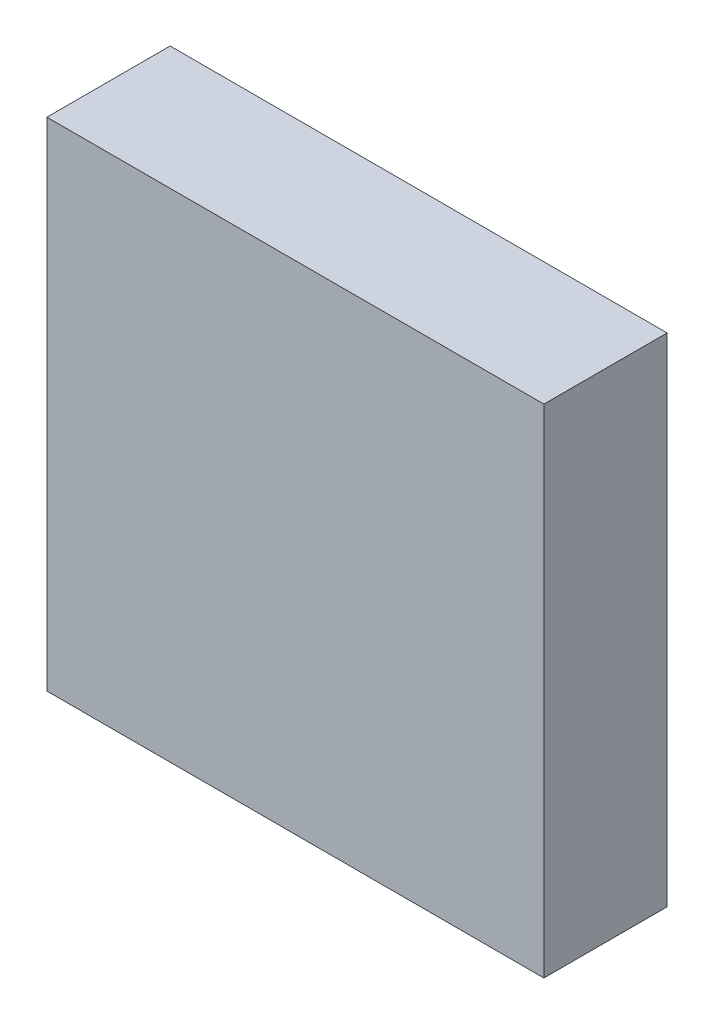
ISO-10303-21;
HEADER;
FILE_DESCRIPTION(('STEP AP214'),'2;1');
FILE_NAME('part.step','',(''),(''),'','','');
FILE_SCHEMA(('AUTOMOTIVE_DESIGN { 1 0 10303 214 1 1 1 1 }'));
ENDSEC;
DATA;
#1=APPLICATION_CONTEXT('core data for automotive mechanical design processes');
#2=APPLICATION_PROTOCOL_DEFINITION('international standard','automotive_design',2000,#1);
#3=PRODUCT_CONTEXT('',#1,'mechanical');
#4=PRODUCT('Part','Part','',(#3));
#5=PRODUCT_RELATED_PRODUCT_CATEGORY('part','',(#4));
#6=PRODUCT_DEFINITION_FORMATION('','',#4);
#7=PRODUCT_DEFINITION_CONTEXT('part definition',#1,'design');
#8=PRODUCT_DEFINITION('design','',#6,#7);
#9=PRODUCT_DEFINITION_SHAPE('','',#8);
#10=(LENGTH_UNIT() NAMED_UNIT(*) SI_UNIT(.MILLI.,.METRE.));
#11=(NAMED_UNIT(*) PLANE_ANGLE_UNIT() SI_UNIT($,.RADIAN.));
#12=(NAMED_UNIT(*) SI_UNIT($,.STERADIAN.) SOLID_ANGLE_UNIT());
#13=UNCERTAINTY_MEASURE_WITH_UNIT(LENGTH_MEASURE(1.E-05),#10,'distance_accuracy_value','');
#14=(GEOMETRIC_REPRESENTATION_CONTEXT(3) GLOBAL_UNCERTAINTY_ASSIGNED_CONTEXT((#13)) GLOBAL_UNIT_ASSIGNED_CONTEXT((#10,
#11,#12)) REPRESENTATION_CONTEXT('',''));
#15=CARTESIAN_POINT('',(0.,0.,0.));
#16=DIRECTION('',(0.,0.,1.));
#17=DIRECTION('',(1.,0.,0.));
#18=AXIS2_PLACEMENT_3D('',#15,#16,#17);
#19=CARTESIAN_POINT('',(3.1250001,3.1250001,1.55000198));
#20=DIRECTION('',(0.,0.,-1.));
#21=DIRECTION('',(-1.,0.,0.));
#22=AXIS2_PLACEMENT_3D('',#19,#20,#21);
#23=PLANE('',#22);
#24=DIRECTION('',(0.,1.,0.));
#25=VECTOR('',#24,1.);
#26=CARTESIAN_POINT('',(-3.1250001,3.1250001,1.55000198));
#27=LINE('',#26,#25);
#28=CARTESIAN_POINT('',(-3.1250001,3.1250001,1.55000198));
#29=VERTEX_POINT('',#28);
#30=CARTESIAN_POINT('',(-3.1250001,-3.1250001,1.55000198));
#31=VERTEX_POINT('',#30);
#32=EDGE_CURVE('E54',#29,#31,#27,.F.);
#33=ORIENTED_EDGE('',*,*,#32,.T.);
#34=DIRECTION('',(1.,0.,0.));
#35=VECTOR('',#34,1.);
#36=CARTESIAN_POINT('',(-3.1250001,-3.1250001,1.55000198));
#37=LINE('',#36,#35);
#38=CARTESIAN_POINT('',(3.1250001,-3.1250001,1.55000198));
#39=VERTEX_POINT('',#38);
#40=EDGE_CURVE('E56',#31,#39,#37,.T.);
#41=ORIENTED_EDGE('',*,*,#40,.T.);
#42=DIRECTION('',(0.,1.,0.));
#43=VECTOR('',#42,1.);
#44=CARTESIAN_POINT('',(3.1250001,-3.1250001,1.55000198));
#45=LINE('',#44,#43);
#46=CARTESIAN_POINT('',(3.1250001,3.1250001,1.55000198));
#47=VERTEX_POINT('',#46);
#48=EDGE_CURVE('E19',#39,#47,#45,.T.);
#49=ORIENTED_EDGE('',*,*,#48,.T.);
#50=DIRECTION('',(1.,0.,0.));
#51=VECTOR('',#50,1.);
#52=CARTESIAN_POINT('',(3.1250001,3.1250001,1.55000198));
#53=LINE('',#52,#51);
#54=EDGE_CURVE('E79',#47,#29,#53,.F.);
#55=ORIENTED_EDGE('',*,*,#54,.T.);
#56=EDGE_LOOP('',(#33,#41,#49,#55));
#57=FACE_BOUND('',#56,.T.);
#58=ADVANCED_FACE('F16',(#57),#23,.F.);
#59=CARTESIAN_POINT('',(3.1250001,-3.1250001,0.));
#60=DIRECTION('',(-1.,0.,0.));
#61=DIRECTION('',(0.,0.,1.));
#62=AXIS2_PLACEMENT_3D('',#59,#60,#61);
#63=PLANE('',#62);
#64=DIRECTION('',(0.,0.,-1.));
#65=VECTOR('',#64,1.);
#66=CARTESIAN_POINT('',(3.1250001,3.1250001,0.));
#67=LINE('',#66,#65);
#68=CARTESIAN_POINT('',(3.1250001,3.1250001,0.));
#69=VERTEX_POINT('',#68);
#70=EDGE_CURVE('E67',#69,#47,#67,.F.);
#71=ORIENTED_EDGE('',*,*,#70,.T.);
#72=ORIENTED_EDGE('',*,*,#48,.F.);
#73=DIRECTION('',(0.,0.,1.));
#74=VECTOR('',#73,1.);
#75=CARTESIAN_POINT('',(3.1250001,-3.1250001,0.));
#76=LINE('',#75,#74);
#77=CARTESIAN_POINT('',(3.1250001,-3.1250001,0.));
#78=VERTEX_POINT('',#77);
#79=EDGE_CURVE('E62',#39,#78,#76,.F.);
#80=ORIENTED_EDGE('',*,*,#79,.T.);
#81=DIRECTION('',(0.,1.,0.));
#82=VECTOR('',#81,1.);
#83=CARTESIAN_POINT('',(3.1250001,3.1250001,0.));
#84=LINE('',#83,#82);
#85=EDGE_CURVE('E82',#69,#78,#84,.F.);
#86=ORIENTED_EDGE('',*,*,#85,.F.);
#87=EDGE_LOOP('',(#71,#72,#80,#86));
#88=FACE_BOUND('',#87,.T.);
#89=ADVANCED_FACE('F64',(#88),#63,.F.);
#90=CARTESIAN_POINT('',(-3.1250001,-3.1250001,0.));
#91=DIRECTION('',(0.,1.,0.));
#92=DIRECTION('',(0.,0.,1.));
#93=AXIS2_PLACEMENT_3D('',#90,#91,#92);
#94=PLANE('',#93);
#95=ORIENTED_EDGE('',*,*,#79,.F.);
#96=ORIENTED_EDGE('',*,*,#40,.F.);
#97=DIRECTION('',(0.,0.,-1.));
#98=VECTOR('',#97,1.);
#99=CARTESIAN_POINT('',(-3.1250001,-3.1250001,0.));
#100=LINE('',#99,#98);
#101=CARTESIAN_POINT('',(-3.1250001,-3.1250001,0.));
#102=VERTEX_POINT('',#101);
#103=EDGE_CURVE('E74',#31,#102,#100,.T.);
#104=ORIENTED_EDGE('',*,*,#103,.T.);
#105=DIRECTION('',(-1.,0.,0.));
#106=VECTOR('',#105,1.);
#107=CARTESIAN_POINT('',(3.1250001,-3.1250001,0.));
#108=LINE('',#107,#106);
#109=EDGE_CURVE('E71',#78,#102,#108,.T.);
#110=ORIENTED_EDGE('',*,*,#109,.F.);
#111=EDGE_LOOP('',(#95,#96,#104,#110));
#112=FACE_BOUND('',#111,.T.);
#113=ADVANCED_FACE('F69',(#112),#94,.F.);
#114=CARTESIAN_POINT('',(-3.1250001,3.1250001,0.));
#115=DIRECTION('',(1.,0.,0.));
#116=DIRECTION('',(0.,0.,-1.));
#117=AXIS2_PLACEMENT_3D('',#114,#115,#116);
#118=PLANE('',#117);
#119=ORIENTED_EDGE('',*,*,#103,.F.);
#120=ORIENTED_EDGE('',*,*,#32,.F.);
#121=DIRECTION('',(0.,0.,-1.));
#122=VECTOR('',#121,1.);
#123=CARTESIAN_POINT('',(-3.1250001,3.1250001,0.));
#124=LINE('',#123,#122);
#125=CARTESIAN_POINT('',(-3.1250001,3.1250001,0.));
#126=VERTEX_POINT('',#125);
#127=EDGE_CURVE('E34',#29,#126,#124,.T.);
#128=ORIENTED_EDGE('',*,*,#127,.T.);
#129=DIRECTION('',(0.,1.,0.));
#130=VECTOR('',#129,1.);
#131=CARTESIAN_POINT('',(-3.1250001,3.1250001,0.));
#132=LINE('',#131,#130);
#133=EDGE_CURVE('E25',#102,#126,#132,.T.);
#134=ORIENTED_EDGE('',*,*,#133,.F.);
#135=EDGE_LOOP('',(#119,#120,#128,#134));
#136=FACE_BOUND('',#135,.T.);
#137=ADVANCED_FACE('F88',(#136),#118,.F.);
#138=CARTESIAN_POINT('',(3.1250001,3.1250001,0.));
#139=DIRECTION('',(0.,-1.,0.));
#140=DIRECTION('',(0.,0.,-1.));
#141=AXIS2_PLACEMENT_3D('',#138,#139,#140);
#142=PLANE('',#141);
#143=ORIENTED_EDGE('',*,*,#127,.F.);
#144=ORIENTED_EDGE('',*,*,#54,.F.);
#145=ORIENTED_EDGE('',*,*,#70,.F.);
#146=DIRECTION('',(-1.,0.,0.));
#147=VECTOR('',#146,1.);
#148=CARTESIAN_POINT('',(3.1250001,3.1250001,0.));
#149=LINE('',#148,#147);
#150=EDGE_CURVE('E11',#126,#69,#149,.F.);
#151=ORIENTED_EDGE('',*,*,#150,.F.);
#152=EDGE_LOOP('',(#143,#144,#145,#151));
#153=FACE_BOUND('',#152,.T.);
#154=ADVANCED_FACE('F90',(#153),#142,.F.);
#155=CARTESIAN_POINT('',(3.1250001,3.1250001,0.));
#156=DIRECTION('',(0.,0.,-1.));
#157=DIRECTION('',(-1.,0.,0.));
#158=AXIS2_PLACEMENT_3D('',#155,#156,#157);
#159=PLANE('',#158);
#160=ORIENTED_EDGE('',*,*,#133,.T.);
#161=ORIENTED_EDGE('',*,*,#150,.T.);
#162=ORIENTED_EDGE('',*,*,#85,.T.);
#163=ORIENTED_EDGE('',*,*,#109,.T.);
#164=EDGE_LOOP('',(#160,#161,#162,#163));
#165=FACE_BOUND('',#164,.T.);
#166=ADVANCED_FACE('F87',(#165),#159,.T.);
#167=CLOSED_SHELL('',(#58,#89,#113,#137,#154,#166));
#168=MANIFOLD_SOLID_BREP('B1',#167);
#169=ADVANCED_BREP_SHAPE_REPRESENTATION('',(#18,#168),#14);
#170=SHAPE_DEFINITION_REPRESENTATION(#9,#169);
ENDSEC;
END-ISO-10303-21;
